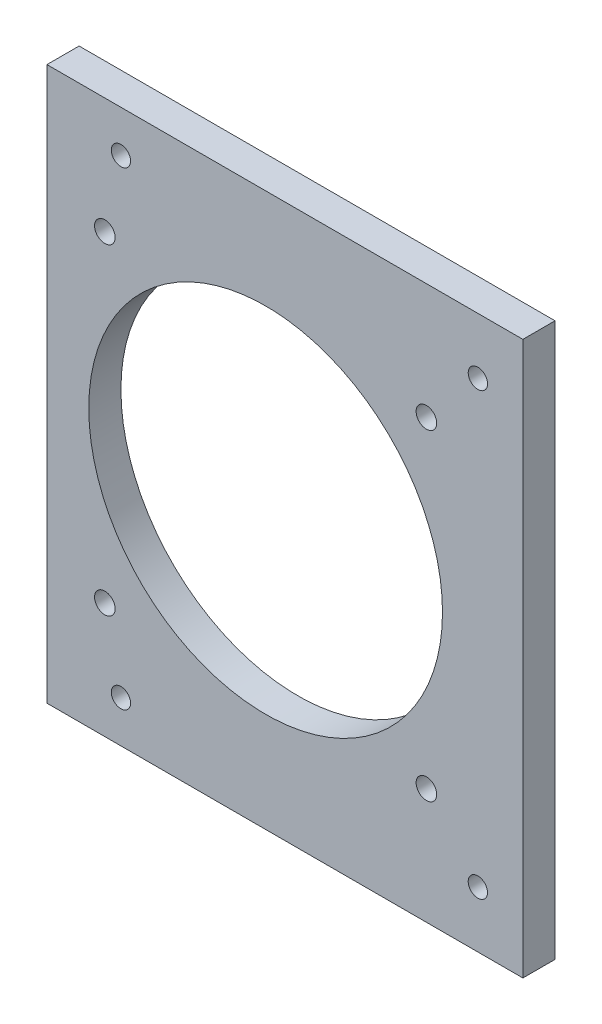
ISO-10303-21;
HEADER;
FILE_DESCRIPTION(('STEP AP214'),'2;1');
FILE_NAME('part.step','',(''),(''),'','','');
FILE_SCHEMA(('AUTOMOTIVE_DESIGN { 1 0 10303 214 1 1 1 1 }'));
ENDSEC;
DATA;
#1=APPLICATION_CONTEXT('core data for automotive mechanical design processes');
#2=APPLICATION_PROTOCOL_DEFINITION('international standard','automotive_design',2000,#1);
#3=PRODUCT_CONTEXT('',#1,'mechanical');
#4=PRODUCT('Part','Part','',(#3));
#5=PRODUCT_RELATED_PRODUCT_CATEGORY('part','',(#4));
#6=PRODUCT_DEFINITION_FORMATION('','',#4);
#7=PRODUCT_DEFINITION_CONTEXT('part definition',#1,'design');
#8=PRODUCT_DEFINITION('design','',#6,#7);
#9=PRODUCT_DEFINITION_SHAPE('','',#8);
#10=(LENGTH_UNIT() NAMED_UNIT(*) SI_UNIT(.MILLI.,.METRE.));
#11=(NAMED_UNIT(*) PLANE_ANGLE_UNIT() SI_UNIT($,.RADIAN.));
#12=(NAMED_UNIT(*) SI_UNIT($,.STERADIAN.) SOLID_ANGLE_UNIT());
#13=UNCERTAINTY_MEASURE_WITH_UNIT(LENGTH_MEASURE(1.E-05),#10,'distance_accuracy_value','');
#14=(GEOMETRIC_REPRESENTATION_CONTEXT(3) GLOBAL_UNCERTAINTY_ASSIGNED_CONTEXT((#13)) GLOBAL_UNIT_ASSIGNED_CONTEXT((#10,
#11,#12)) REPRESENTATION_CONTEXT('',''));
#15=CARTESIAN_POINT('',(0.,0.,0.));
#16=DIRECTION('',(0.,0.,1.));
#17=DIRECTION('',(1.,0.,0.));
#18=AXIS2_PLACEMENT_3D('',#15,#16,#17);
#19=CARTESIAN_POINT('',(2.50000000000003,-4.99999999999999,76.0000000000007));
#20=DIRECTION('',(1.,0.,0.));
#21=DIRECTION('',(0.,1.,0.));
#22=AXIS2_PLACEMENT_3D('',#19,#20,#21);
#23=PLANE('',#22);
#24=DIRECTION('',(0.,1.,0.));
#25=VECTOR('',#24,1.);
#26=CARTESIAN_POINT('',(2.50000000000003,-4.99999999999999,81.0000000000007));
#27=LINE('',#26,#25);
#28=CARTESIAN_POINT('',(2.50000000000003,2.00000000000001,81.0000000000007));
#29=VERTEX_POINT('',#28);
#30=CARTESIAN_POINT('',(2.50000000000002,88.,81.0000000000007));
#31=VERTEX_POINT('',#30);
#32=EDGE_CURVE('E36',#29,#31,#27,.T.);
#33=ORIENTED_EDGE('',*,*,#32,.F.);
#34=DIRECTION('',(0.,0.,1.));
#35=VECTOR('',#34,1.);
#36=CARTESIAN_POINT('',(2.50000000000003,2.00000000000001,76.0000000000007));
#37=LINE('',#36,#35);
#38=CARTESIAN_POINT('',(2.50000000000003,2.00000000000001,76.0000000000007));
#39=VERTEX_POINT('',#38);
#40=EDGE_CURVE('E72',#39,#29,#37,.T.);
#41=ORIENTED_EDGE('',*,*,#40,.F.);
#42=DIRECTION('',(0.,1.,0.));
#43=VECTOR('',#42,1.);
#44=CARTESIAN_POINT('',(2.50000000000003,-4.99999999999999,76.0000000000007));
#45=LINE('',#44,#43);
#46=CARTESIAN_POINT('',(2.50000000000002,88.,76.0000000000007));
#47=VERTEX_POINT('',#46);
#48=EDGE_CURVE('E11',#39,#47,#45,.T.);
#49=ORIENTED_EDGE('',*,*,#48,.T.);
#50=DIRECTION('',(0.,0.,-1.));
#51=VECTOR('',#50,1.);
#52=CARTESIAN_POINT('',(2.50000000000002,88.,81.0000000000007));
#53=LINE('',#52,#51);
#54=EDGE_CURVE('E89',#31,#47,#53,.T.);
#55=ORIENTED_EDGE('',*,*,#54,.F.);
#56=EDGE_LOOP('',(#33,#41,#49,#55));
#57=FACE_BOUND('',#56,.T.);
#58=ADVANCED_FACE('F33',(#57),#23,.T.);
#59=CARTESIAN_POINT('',(0.,0.,76.0000000000007));
#60=DIRECTION('',(0.,0.,1.));
#61=DIRECTION('',(1.,0.,0.));
#62=AXIS2_PLACEMENT_3D('',#59,#60,#61);
#63=PLANE('',#62);
#64=CARTESIAN_POINT('',(-37.4999999999983,45.,76.0000000000007));
#65=DIRECTION('',(0.,0.,1.));
#66=DIRECTION('',(1.,0.,0.));
#67=AXIS2_PLACEMENT_3D('',#64,#65,#66);
#68=CIRCLE('',#67,27.5);
#69=CARTESIAN_POINT('',(-9.9999999999983,45.,76.0000000000007));
#70=VERTEX_POINT('',#69);
#71=EDGE_CURVE('E139',#70,#70,#68,.T.);
#72=ORIENTED_EDGE('',*,*,#71,.T.);
#73=EDGE_LOOP('',(#72));
#74=FACE_BOUND('',#73,.T.);
#75=CARTESIAN_POINT('',(-62.4999999999983,70.,76.0000000000007));
#76=DIRECTION('',(0.,0.,1.));
#77=DIRECTION('',(1.,0.,0.));
#78=AXIS2_PLACEMENT_3D('',#75,#76,#77);
#79=CIRCLE('',#78,1.6);
#80=CARTESIAN_POINT('',(-60.8999999999983,70.,76.0000000000007));
#81=VERTEX_POINT('',#80);
#82=EDGE_CURVE('E133',#81,#81,#79,.T.);
#83=ORIENTED_EDGE('',*,*,#82,.T.);
#84=EDGE_LOOP('',(#83));
#85=FACE_BOUND('',#84,.T.);
#86=CARTESIAN_POINT('',(-62.4999999999983,20.,76.0000000000007));
#87=DIRECTION('',(0.,0.,1.));
#88=DIRECTION('',(1.,0.,0.));
#89=AXIS2_PLACEMENT_3D('',#86,#87,#88);
#90=CIRCLE('',#89,1.6);
#91=CARTESIAN_POINT('',(-60.8999999999983,20.,76.0000000000007));
#92=VERTEX_POINT('',#91);
#93=EDGE_CURVE('E127',#92,#92,#90,.T.);
#94=ORIENTED_EDGE('',*,*,#93,.T.);
#95=EDGE_LOOP('',(#94));
#96=FACE_BOUND('',#95,.T.);
#97=CARTESIAN_POINT('',(-12.4999999999983,20.,76.0000000000007));
#98=DIRECTION('',(0.,0.,1.));
#99=DIRECTION('',(1.,0.,0.));
#100=AXIS2_PLACEMENT_3D('',#97,#98,#99);
#101=CIRCLE('',#100,1.6);
#102=CARTESIAN_POINT('',(-10.8999999999983,20.,76.0000000000007));
#103=VERTEX_POINT('',#102);
#104=EDGE_CURVE('E121',#103,#103,#101,.T.);
#105=ORIENTED_EDGE('',*,*,#104,.T.);
#106=EDGE_LOOP('',(#105));
#107=FACE_BOUND('',#106,.T.);
#108=CARTESIAN_POINT('',(-12.4999999999983,70.,76.0000000000007));
#109=DIRECTION('',(0.,0.,1.));
#110=DIRECTION('',(1.,0.,0.));
#111=AXIS2_PLACEMENT_3D('',#108,#109,#110);
#112=CIRCLE('',#111,1.6);
#113=CARTESIAN_POINT('',(-10.8999999999983,70.,76.0000000000007));
#114=VERTEX_POINT('',#113);
#115=EDGE_CURVE('E115',#114,#114,#112,.T.);
#116=ORIENTED_EDGE('',*,*,#115,.T.);
#117=EDGE_LOOP('',(#116));
#118=FACE_BOUND('',#117,.T.);
#119=CARTESIAN_POINT('',(-4.49999999999956,10.75,76.0000000000007));
#120=DIRECTION('',(0.,0.,1.));
#121=DIRECTION('',(1.,0.,0.));
#122=AXIS2_PLACEMENT_3D('',#119,#120,#121);
#123=CIRCLE('',#122,1.49999999999959);
#124=CARTESIAN_POINT('',(-2.99999999999996,10.75,76.0000000000007));
#125=VERTEX_POINT('',#124);
#126=EDGE_CURVE('E109',#125,#125,#123,.T.);
#127=ORIENTED_EDGE('',*,*,#126,.T.);
#128=EDGE_LOOP('',(#127));
#129=FACE_BOUND('',#128,.T.);
#130=CARTESIAN_POINT('',(-4.49999999999956,79.25,76.0000000000007));
#131=DIRECTION('',(0.,0.,1.));
#132=DIRECTION('',(1.,0.,0.));
#133=AXIS2_PLACEMENT_3D('',#130,#131,#132);
#134=CIRCLE('',#133,1.49999999999961);
#135=CARTESIAN_POINT('',(-2.99999999999995,79.25,76.0000000000007));
#136=VERTEX_POINT('',#135);
#137=EDGE_CURVE('E103',#136,#136,#134,.T.);
#138=ORIENTED_EDGE('',*,*,#137,.T.);
#139=EDGE_LOOP('',(#138));
#140=FACE_BOUND('',#139,.T.);
#141=CARTESIAN_POINT('',(-59.9999999999996,81.5,76.0000000000007));
#142=DIRECTION('',(0.,0.,1.));
#143=DIRECTION('',(1.,0.,0.));
#144=AXIS2_PLACEMENT_3D('',#141,#142,#143);
#145=CIRCLE('',#144,1.4999999999996);
#146=CARTESIAN_POINT('',(-58.5,81.5,76.0000000000007));
#147=VERTEX_POINT('',#146);
#148=EDGE_CURVE('E97',#147,#147,#145,.T.);
#149=ORIENTED_EDGE('',*,*,#148,.T.);
#150=EDGE_LOOP('',(#149));
#151=FACE_BOUND('',#150,.T.);
#152=CARTESIAN_POINT('',(-59.9999999999983,8.50000000000006,76.0000000000007));
#153=DIRECTION('',(0.,0.,1.));
#154=DIRECTION('',(1.,0.,0.));
#155=AXIS2_PLACEMENT_3D('',#152,#153,#154);
#156=CIRCLE('',#155,1.49999999999842);
#157=CARTESIAN_POINT('',(-58.4999999999999,8.50000000000006,76.0000000000007));
#158=VERTEX_POINT('',#157);
#159=EDGE_CURVE('E90',#158,#158,#156,.T.);
#160=ORIENTED_EDGE('',*,*,#159,.T.);
#161=EDGE_LOOP('',(#160));
#162=FACE_BOUND('',#161,.T.);
#163=DIRECTION('',(1.,0.,0.));
#164=VECTOR('',#163,1.);
#165=CARTESIAN_POINT('',(-71.4999999999987,2.00000000000001,76.0000000000007));
#166=LINE('',#165,#164);
#167=CARTESIAN_POINT('',(-71.4999999999987,2.00000000000001,76.0000000000007));
#168=VERTEX_POINT('',#167);
#169=EDGE_CURVE('E75',#168,#39,#166,.T.);
#170=ORIENTED_EDGE('',*,*,#169,.F.);
#171=DIRECTION('',(0.,-1.,0.));
#172=VECTOR('',#171,1.);
#173=CARTESIAN_POINT('',(-71.4999999999987,95.,76.0000000000007));
#174=LINE('',#173,#172);
#175=CARTESIAN_POINT('',(-71.4999999999987,88.,76.0000000000007));
#176=VERTEX_POINT('',#175);
#177=EDGE_CURVE('E145',#176,#168,#174,.T.);
#178=ORIENTED_EDGE('',*,*,#177,.F.);
#179=DIRECTION('',(-1.,0.,0.));
#180=VECTOR('',#179,1.);
#181=CARTESIAN_POINT('',(2.50000000000002,88.,76.0000000000007));
#182=LINE('',#181,#180);
#183=EDGE_CURVE('E55',#47,#176,#182,.T.);
#184=ORIENTED_EDGE('',*,*,#183,.F.);
#185=ORIENTED_EDGE('',*,*,#48,.F.);
#186=EDGE_LOOP('',(#170,#178,#184,#185));
#187=FACE_BOUND('',#186,.T.);
#188=ADVANCED_FACE('F161',(#74,#85,#96,#107,#118,#129,#140,#151,#162,#187),#63,.F.);
#189=CARTESIAN_POINT('',(0.,0.,81.0000000000007));
#190=DIRECTION('',(0.,0.,1.));
#191=DIRECTION('',(1.,0.,0.));
#192=AXIS2_PLACEMENT_3D('',#189,#190,#191);
#193=PLANE('',#192);
#194=CARTESIAN_POINT('',(-37.4999999999983,45.,81.0000000000007));
#195=DIRECTION('',(0.,0.,1.));
#196=DIRECTION('',(1.,0.,0.));
#197=AXIS2_PLACEMENT_3D('',#194,#195,#196);
#198=CIRCLE('',#197,27.5);
#199=CARTESIAN_POINT('',(-9.9999999999983,45.,81.0000000000007));
#200=VERTEX_POINT('',#199);
#201=EDGE_CURVE('E142',#200,#200,#198,.T.);
#202=ORIENTED_EDGE('',*,*,#201,.F.);
#203=EDGE_LOOP('',(#202));
#204=FACE_BOUND('',#203,.T.);
#205=CARTESIAN_POINT('',(-62.4999999999983,70.,81.0000000000007));
#206=DIRECTION('',(0.,0.,1.));
#207=DIRECTION('',(1.,0.,0.));
#208=AXIS2_PLACEMENT_3D('',#205,#206,#207);
#209=CIRCLE('',#208,1.6);
#210=CARTESIAN_POINT('',(-60.8999999999983,70.,81.0000000000007));
#211=VERTEX_POINT('',#210);
#212=EDGE_CURVE('E136',#211,#211,#209,.T.);
#213=ORIENTED_EDGE('',*,*,#212,.F.);
#214=EDGE_LOOP('',(#213));
#215=FACE_BOUND('',#214,.T.);
#216=CARTESIAN_POINT('',(-62.4999999999983,20.,81.0000000000007));
#217=DIRECTION('',(0.,0.,1.));
#218=DIRECTION('',(1.,0.,0.));
#219=AXIS2_PLACEMENT_3D('',#216,#217,#218);
#220=CIRCLE('',#219,1.6);
#221=CARTESIAN_POINT('',(-60.8999999999983,20.,81.0000000000007));
#222=VERTEX_POINT('',#221);
#223=EDGE_CURVE('E130',#222,#222,#220,.T.);
#224=ORIENTED_EDGE('',*,*,#223,.F.);
#225=EDGE_LOOP('',(#224));
#226=FACE_BOUND('',#225,.T.);
#227=CARTESIAN_POINT('',(-12.4999999999983,20.,81.0000000000007));
#228=DIRECTION('',(0.,0.,1.));
#229=DIRECTION('',(1.,0.,0.));
#230=AXIS2_PLACEMENT_3D('',#227,#228,#229);
#231=CIRCLE('',#230,1.6);
#232=CARTESIAN_POINT('',(-10.8999999999983,20.,81.0000000000007));
#233=VERTEX_POINT('',#232);
#234=EDGE_CURVE('E124',#233,#233,#231,.T.);
#235=ORIENTED_EDGE('',*,*,#234,.F.);
#236=EDGE_LOOP('',(#235));
#237=FACE_BOUND('',#236,.T.);
#238=CARTESIAN_POINT('',(-12.4999999999983,70.,81.0000000000007));
#239=DIRECTION('',(0.,0.,1.));
#240=DIRECTION('',(1.,0.,0.));
#241=AXIS2_PLACEMENT_3D('',#238,#239,#240);
#242=CIRCLE('',#241,1.6);
#243=CARTESIAN_POINT('',(-10.8999999999983,70.,81.0000000000007));
#244=VERTEX_POINT('',#243);
#245=EDGE_CURVE('E118',#244,#244,#242,.T.);
#246=ORIENTED_EDGE('',*,*,#245,.F.);
#247=EDGE_LOOP('',(#246));
#248=FACE_BOUND('',#247,.T.);
#249=CARTESIAN_POINT('',(-4.49999999999956,10.75,81.0000000000007));
#250=DIRECTION('',(0.,0.,1.));
#251=DIRECTION('',(1.,0.,0.));
#252=AXIS2_PLACEMENT_3D('',#249,#250,#251);
#253=CIRCLE('',#252,1.49999999999959);
#254=CARTESIAN_POINT('',(-2.99999999999996,10.75,81.0000000000007));
#255=VERTEX_POINT('',#254);
#256=EDGE_CURVE('E112',#255,#255,#253,.T.);
#257=ORIENTED_EDGE('',*,*,#256,.F.);
#258=EDGE_LOOP('',(#257));
#259=FACE_BOUND('',#258,.T.);
#260=CARTESIAN_POINT('',(-4.49999999999956,79.25,81.0000000000007));
#261=DIRECTION('',(0.,0.,1.));
#262=DIRECTION('',(1.,0.,0.));
#263=AXIS2_PLACEMENT_3D('',#260,#261,#262);
#264=CIRCLE('',#263,1.49999999999961);
#265=CARTESIAN_POINT('',(-2.99999999999995,79.25,81.0000000000007));
#266=VERTEX_POINT('',#265);
#267=EDGE_CURVE('E106',#266,#266,#264,.T.);
#268=ORIENTED_EDGE('',*,*,#267,.F.);
#269=EDGE_LOOP('',(#268));
#270=FACE_BOUND('',#269,.T.);
#271=CARTESIAN_POINT('',(-59.9999999999996,81.5,81.0000000000007));
#272=DIRECTION('',(0.,0.,1.));
#273=DIRECTION('',(1.,0.,0.));
#274=AXIS2_PLACEMENT_3D('',#271,#272,#273);
#275=CIRCLE('',#274,1.4999999999996);
#276=CARTESIAN_POINT('',(-58.5,81.5,81.0000000000007));
#277=VERTEX_POINT('',#276);
#278=EDGE_CURVE('E100',#277,#277,#275,.T.);
#279=ORIENTED_EDGE('',*,*,#278,.F.);
#280=EDGE_LOOP('',(#279));
#281=FACE_BOUND('',#280,.T.);
#282=CARTESIAN_POINT('',(-59.9999999999983,8.50000000000006,81.0000000000007));
#283=DIRECTION('',(0.,0.,1.));
#284=DIRECTION('',(1.,0.,0.));
#285=AXIS2_PLACEMENT_3D('',#282,#283,#284);
#286=CIRCLE('',#285,1.49999999999842);
#287=CARTESIAN_POINT('',(-58.4999999999999,8.50000000000006,81.0000000000007));
#288=VERTEX_POINT('',#287);
#289=EDGE_CURVE('E92',#288,#288,#286,.T.);
#290=ORIENTED_EDGE('',*,*,#289,.F.);
#291=EDGE_LOOP('',(#290));
#292=FACE_BOUND('',#291,.T.);
#293=DIRECTION('',(0.,1.,0.));
#294=VECTOR('',#293,1.);
#295=CARTESIAN_POINT('',(-71.4999999999987,-4.99999999999999,81.0000000000007));
#296=LINE('',#295,#294);
#297=CARTESIAN_POINT('',(-71.4999999999987,2.00000000000001,81.0000000000007));
#298=VERTEX_POINT('',#297);
#299=CARTESIAN_POINT('',(-71.4999999999987,88.,81.0000000000007));
#300=VERTEX_POINT('',#299);
#301=EDGE_CURVE('E85',#298,#300,#296,.T.);
#302=ORIENTED_EDGE('',*,*,#301,.F.);
#303=DIRECTION('',(-1.,0.,0.));
#304=VECTOR('',#303,1.);
#305=CARTESIAN_POINT('',(2.50000000000003,2.00000000000001,81.0000000000007));
#306=LINE('',#305,#304);
#307=EDGE_CURVE('E47',#29,#298,#306,.T.);
#308=ORIENTED_EDGE('',*,*,#307,.F.);
#309=ORIENTED_EDGE('',*,*,#32,.T.);
#310=DIRECTION('',(1.,0.,0.));
#311=VECTOR('',#310,1.);
#312=CARTESIAN_POINT('',(-71.4999999999987,88.,81.0000000000007));
#313=LINE('',#312,#311);
#314=EDGE_CURVE('E153',#300,#31,#313,.T.);
#315=ORIENTED_EDGE('',*,*,#314,.F.);
#316=EDGE_LOOP('',(#302,#308,#309,#315));
#317=FACE_BOUND('',#316,.T.);
#318=ADVANCED_FACE('F82',(#204,#215,#226,#237,#248,#259,#270,#281,#292,#317),#193,.T.);
#319=CARTESIAN_POINT('',(-71.4999999999987,0.,0.));
#320=DIRECTION('',(-1.,0.,0.));
#321=DIRECTION('',(0.,0.,1.));
#322=AXIS2_PLACEMENT_3D('',#319,#320,#321);
#323=PLANE('',#322);
#324=ORIENTED_EDGE('',*,*,#177,.T.);
#325=DIRECTION('',(0.,0.,-1.));
#326=VECTOR('',#325,1.);
#327=CARTESIAN_POINT('',(-71.4999999999987,2.00000000000001,81.0000000000007));
#328=LINE('',#327,#326);
#329=EDGE_CURVE('E86',#298,#168,#328,.T.);
#330=ORIENTED_EDGE('',*,*,#329,.F.);
#331=ORIENTED_EDGE('',*,*,#301,.T.);
#332=DIRECTION('',(0.,0.,1.));
#333=VECTOR('',#332,1.);
#334=CARTESIAN_POINT('',(-71.4999999999987,88.,76.0000000000007));
#335=LINE('',#334,#333);
#336=EDGE_CURVE('E155',#176,#300,#335,.T.);
#337=ORIENTED_EDGE('',*,*,#336,.F.);
#338=EDGE_LOOP('',(#324,#330,#331,#337));
#339=FACE_BOUND('',#338,.T.);
#340=ADVANCED_FACE('F162',(#339),#323,.T.);
#341=CARTESIAN_POINT('',(-59.9999999999983,8.50000000000006,76.0000000000007));
#342=DIRECTION('',(0.,0.,1.));
#343=DIRECTION('',(1.,0.,0.));
#344=AXIS2_PLACEMENT_3D('',#341,#342,#343);
#345=CYLINDRICAL_SURFACE('',#344,1.49999999999842);
#346=ORIENTED_EDGE('',*,*,#159,.F.);
#347=EDGE_LOOP('',(#346));
#348=FACE_BOUND('',#347,.T.);
#349=ORIENTED_EDGE('',*,*,#289,.T.);
#350=EDGE_LOOP('',(#349));
#351=FACE_BOUND('',#350,.T.);
#352=ADVANCED_FACE('F188',(#348,#351),#345,.F.);
#353=CARTESIAN_POINT('',(-59.9999999999996,81.5,76.0000000000007));
#354=DIRECTION('',(0.,0.,1.));
#355=DIRECTION('',(1.,0.,0.));
#356=AXIS2_PLACEMENT_3D('',#353,#354,#355);
#357=CYLINDRICAL_SURFACE('',#356,1.4999999999996);
#358=ORIENTED_EDGE('',*,*,#148,.F.);
#359=EDGE_LOOP('',(#358));
#360=FACE_BOUND('',#359,.T.);
#361=ORIENTED_EDGE('',*,*,#278,.T.);
#362=EDGE_LOOP('',(#361));
#363=FACE_BOUND('',#362,.T.);
#364=ADVANCED_FACE('F191',(#360,#363),#357,.F.);
#365=CARTESIAN_POINT('',(-4.49999999999956,79.25,76.0000000000007));
#366=DIRECTION('',(0.,0.,1.));
#367=DIRECTION('',(1.,0.,0.));
#368=AXIS2_PLACEMENT_3D('',#365,#366,#367);
#369=CYLINDRICAL_SURFACE('',#368,1.49999999999961);
#370=ORIENTED_EDGE('',*,*,#137,.F.);
#371=EDGE_LOOP('',(#370));
#372=FACE_BOUND('',#371,.T.);
#373=ORIENTED_EDGE('',*,*,#267,.T.);
#374=EDGE_LOOP('',(#373));
#375=FACE_BOUND('',#374,.T.);
#376=ADVANCED_FACE('F195',(#372,#375),#369,.F.);
#377=CARTESIAN_POINT('',(-4.49999999999956,10.75,76.0000000000007));
#378=DIRECTION('',(0.,0.,1.));
#379=DIRECTION('',(1.,0.,0.));
#380=AXIS2_PLACEMENT_3D('',#377,#378,#379);
#381=CYLINDRICAL_SURFACE('',#380,1.49999999999959);
#382=ORIENTED_EDGE('',*,*,#126,.F.);
#383=EDGE_LOOP('',(#382));
#384=FACE_BOUND('',#383,.T.);
#385=ORIENTED_EDGE('',*,*,#256,.T.);
#386=EDGE_LOOP('',(#385));
#387=FACE_BOUND('',#386,.T.);
#388=ADVANCED_FACE('F199',(#384,#387),#381,.F.);
#389=CARTESIAN_POINT('',(-12.4999999999983,70.,76.0000000000007));
#390=DIRECTION('',(0.,0.,1.));
#391=DIRECTION('',(1.,0.,0.));
#392=AXIS2_PLACEMENT_3D('',#389,#390,#391);
#393=CYLINDRICAL_SURFACE('',#392,1.6);
#394=ORIENTED_EDGE('',*,*,#115,.F.);
#395=EDGE_LOOP('',(#394));
#396=FACE_BOUND('',#395,.T.);
#397=ORIENTED_EDGE('',*,*,#245,.T.);
#398=EDGE_LOOP('',(#397));
#399=FACE_BOUND('',#398,.T.);
#400=ADVANCED_FACE('F203',(#396,#399),#393,.F.);
#401=CARTESIAN_POINT('',(-12.4999999999983,20.,76.0000000000007));
#402=DIRECTION('',(0.,0.,1.));
#403=DIRECTION('',(1.,0.,0.));
#404=AXIS2_PLACEMENT_3D('',#401,#402,#403);
#405=CYLINDRICAL_SURFACE('',#404,1.6);
#406=ORIENTED_EDGE('',*,*,#104,.F.);
#407=EDGE_LOOP('',(#406));
#408=FACE_BOUND('',#407,.T.);
#409=ORIENTED_EDGE('',*,*,#234,.T.);
#410=EDGE_LOOP('',(#409));
#411=FACE_BOUND('',#410,.T.);
#412=ADVANCED_FACE('F207',(#408,#411),#405,.F.);
#413=CARTESIAN_POINT('',(-62.4999999999983,20.,76.0000000000007));
#414=DIRECTION('',(0.,0.,1.));
#415=DIRECTION('',(1.,0.,0.));
#416=AXIS2_PLACEMENT_3D('',#413,#414,#415);
#417=CYLINDRICAL_SURFACE('',#416,1.6);
#418=ORIENTED_EDGE('',*,*,#93,.F.);
#419=EDGE_LOOP('',(#418));
#420=FACE_BOUND('',#419,.T.);
#421=ORIENTED_EDGE('',*,*,#223,.T.);
#422=EDGE_LOOP('',(#421));
#423=FACE_BOUND('',#422,.T.);
#424=ADVANCED_FACE('F211',(#420,#423),#417,.F.);
#425=CARTESIAN_POINT('',(-62.4999999999983,70.,76.0000000000007));
#426=DIRECTION('',(0.,0.,1.));
#427=DIRECTION('',(1.,0.,0.));
#428=AXIS2_PLACEMENT_3D('',#425,#426,#427);
#429=CYLINDRICAL_SURFACE('',#428,1.6);
#430=ORIENTED_EDGE('',*,*,#82,.F.);
#431=EDGE_LOOP('',(#430));
#432=FACE_BOUND('',#431,.T.);
#433=ORIENTED_EDGE('',*,*,#212,.T.);
#434=EDGE_LOOP('',(#433));
#435=FACE_BOUND('',#434,.T.);
#436=ADVANCED_FACE('F172',(#432,#435),#429,.F.);
#437=CARTESIAN_POINT('',(-37.4999999999983,45.,76.0000000000007));
#438=DIRECTION('',(0.,0.,1.));
#439=DIRECTION('',(1.,0.,0.));
#440=AXIS2_PLACEMENT_3D('',#437,#438,#439);
#441=CYLINDRICAL_SURFACE('',#440,27.5);
#442=ORIENTED_EDGE('',*,*,#71,.F.);
#443=EDGE_LOOP('',(#442));
#444=FACE_BOUND('',#443,.T.);
#445=ORIENTED_EDGE('',*,*,#201,.T.);
#446=EDGE_LOOP('',(#445));
#447=FACE_BOUND('',#446,.T.);
#448=ADVANCED_FACE('F165',(#444,#447),#441,.F.);
#449=CARTESIAN_POINT('',(0.,88.,0.));
#450=DIRECTION('',(0.,1.,0.));
#451=DIRECTION('',(0.,0.,1.));
#452=AXIS2_PLACEMENT_3D('',#449,#450,#451);
#453=PLANE('',#452);
#454=ORIENTED_EDGE('',*,*,#336,.T.);
#455=ORIENTED_EDGE('',*,*,#314,.T.);
#456=ORIENTED_EDGE('',*,*,#54,.T.);
#457=ORIENTED_EDGE('',*,*,#183,.T.);
#458=EDGE_LOOP('',(#454,#455,#456,#457));
#459=FACE_BOUND('',#458,.T.);
#460=ADVANCED_FACE('F163',(#459),#453,.T.);
#461=CARTESIAN_POINT('',(0.,2.00000000000001,0.));
#462=DIRECTION('',(0.,-1.,0.));
#463=DIRECTION('',(0.,0.,-1.));
#464=AXIS2_PLACEMENT_3D('',#461,#462,#463);
#465=PLANE('',#464);
#466=ORIENTED_EDGE('',*,*,#40,.T.);
#467=ORIENTED_EDGE('',*,*,#307,.T.);
#468=ORIENTED_EDGE('',*,*,#329,.T.);
#469=ORIENTED_EDGE('',*,*,#169,.T.);
#470=EDGE_LOOP('',(#466,#467,#468,#469));
#471=FACE_BOUND('',#470,.T.);
#472=ADVANCED_FACE('F73',(#471),#465,.T.);
#473=CLOSED_SHELL('',(#58,#188,#318,#340,#352,#364,#376,#388,#400,#412,#424,#436,#448,#460,#472));
#474=MANIFOLD_SOLID_BREP('B2',#473);
#475=ADVANCED_BREP_SHAPE_REPRESENTATION('',(#18,#474),#14);
#476=SHAPE_DEFINITION_REPRESENTATION(#9,#475);
ENDSEC;
END-ISO-10303-21;
